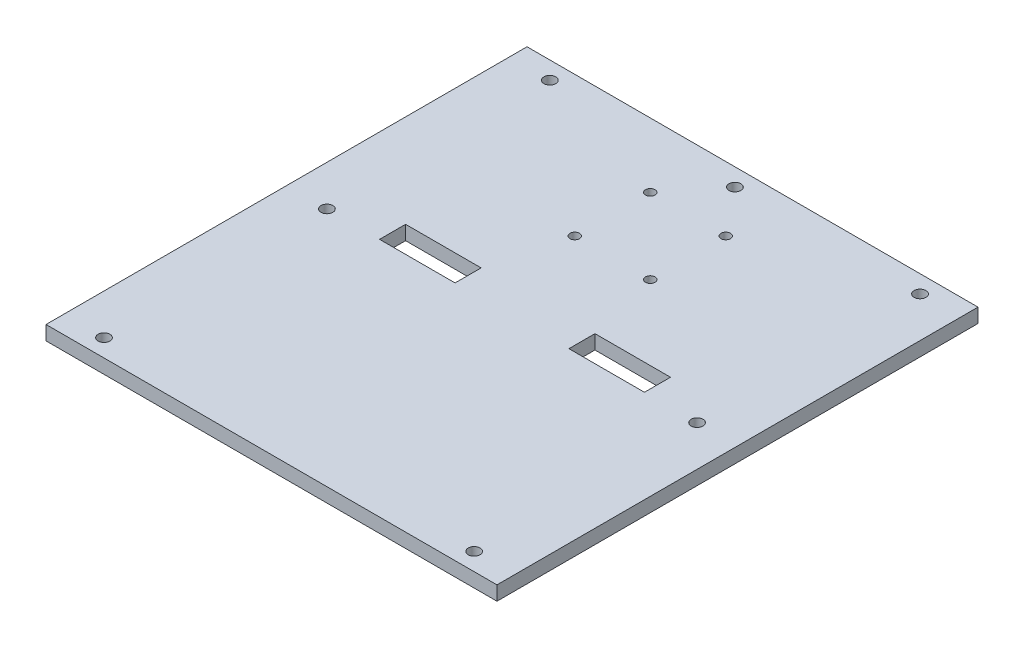
ISO-10303-21;
HEADER;
FILE_DESCRIPTION(('STEP AP214'),'2;1');
FILE_NAME('part.step','',(''),(''),'','','');
FILE_SCHEMA(('AUTOMOTIVE_DESIGN { 1 0 10303 214 1 1 1 1 }'));
ENDSEC;
DATA;
#1=APPLICATION_CONTEXT('core data for automotive mechanical design processes');
#2=APPLICATION_PROTOCOL_DEFINITION('international standard','automotive_design',2000,#1);
#3=PRODUCT_CONTEXT('',#1,'mechanical');
#4=PRODUCT('Part','Part','',(#3));
#5=PRODUCT_RELATED_PRODUCT_CATEGORY('part','',(#4));
#6=PRODUCT_DEFINITION_FORMATION('','',#4);
#7=PRODUCT_DEFINITION_CONTEXT('part definition',#1,'design');
#8=PRODUCT_DEFINITION('design','',#6,#7);
#9=PRODUCT_DEFINITION_SHAPE('','',#8);
#10=(LENGTH_UNIT() NAMED_UNIT(*) SI_UNIT(.MILLI.,.METRE.));
#11=(NAMED_UNIT(*) PLANE_ANGLE_UNIT() SI_UNIT($,.RADIAN.));
#12=(NAMED_UNIT(*) SI_UNIT($,.STERADIAN.) SOLID_ANGLE_UNIT());
#13=UNCERTAINTY_MEASURE_WITH_UNIT(LENGTH_MEASURE(1.E-05),#10,'distance_accuracy_value','');
#14=(GEOMETRIC_REPRESENTATION_CONTEXT(3) GLOBAL_UNCERTAINTY_ASSIGNED_CONTEXT((#13)) GLOBAL_UNIT_ASSIGNED_CONTEXT((#10,
#11,#12)) REPRESENTATION_CONTEXT('',''));
#15=CARTESIAN_POINT('',(0.,0.,0.));
#16=DIRECTION('',(0.,0.,1.));
#17=DIRECTION('',(1.,0.,0.));
#18=AXIS2_PLACEMENT_3D('',#15,#16,#17);
#19=CARTESIAN_POINT('',(0.,6.,0.));
#20=DIRECTION('',(0.,1.,0.));
#21=DIRECTION('',(0.,0.,1.));
#22=AXIS2_PLACEMENT_3D('',#19,#20,#21);
#23=PLANE('',#22);
#24=DIRECTION('',(-1.,0.,0.));
#25=VECTOR('',#24,1.);
#26=CARTESIAN_POINT('',(0.,6.,-11.));
#27=LINE('',#26,#25);
#28=CARTESIAN_POINT('',(55.95,6.,-11.));
#29=VERTEX_POINT('',#28);
#30=CARTESIAN_POINT('',(24.05,6.,-11.));
#31=VERTEX_POINT('',#30);
#32=EDGE_CURVE('E61',#29,#31,#27,.T.);
#33=ORIENTED_EDGE('',*,*,#32,.F.);
#34=DIRECTION('',(0.,0.,1.));
#35=VECTOR('',#34,1.);
#36=CARTESIAN_POINT('',(55.95,6.,0.));
#37=LINE('',#36,#35);
#38=CARTESIAN_POINT('',(55.95,6.,0.));
#39=VERTEX_POINT('',#38);
#40=EDGE_CURVE('E158',#29,#39,#37,.T.);
#41=ORIENTED_EDGE('',*,*,#40,.T.);
#42=DIRECTION('',(1.,0.,0.));
#43=VECTOR('',#42,1.);
#44=CARTESIAN_POINT('',(0.,6.,0.));
#45=LINE('',#44,#43);
#46=CARTESIAN_POINT('',(24.05,6.,0.));
#47=VERTEX_POINT('',#46);
#48=EDGE_CURVE('E142',#47,#39,#45,.T.);
#49=ORIENTED_EDGE('',*,*,#48,.F.);
#50=DIRECTION('',(0.,0.,1.));
#51=VECTOR('',#50,1.);
#52=CARTESIAN_POINT('',(24.05,6.,0.));
#53=LINE('',#52,#51);
#54=EDGE_CURVE('E152',#31,#47,#53,.T.);
#55=ORIENTED_EDGE('',*,*,#54,.F.);
#56=EDGE_LOOP('',(#33,#41,#49,#55));
#57=FACE_BOUND('',#56,.T.);
#58=CARTESIAN_POINT('',(-15.95,6.,-74.35));
#59=DIRECTION('',(0.,1.,0.));
#60=DIRECTION('',(0.,0.,1.));
#61=AXIS2_PLACEMENT_3D('',#58,#59,#60);
#62=CIRCLE('',#61,2.);
#63=CARTESIAN_POINT('',(-15.95,6.,-72.35));
#64=VERTEX_POINT('',#63);
#65=EDGE_CURVE('E168',#64,#64,#62,.T.);
#66=ORIENTED_EDGE('',*,*,#65,.F.);
#67=EDGE_LOOP('',(#66));
#68=FACE_BOUND('',#67,.T.);
#69=CARTESIAN_POINT('',(15.95,6.,-74.35));
#70=DIRECTION('',(0.,1.,0.));
#71=DIRECTION('',(0.,0.,1.));
#72=AXIS2_PLACEMENT_3D('',#69,#70,#71);
#73=CIRCLE('',#72,2.);
#74=CARTESIAN_POINT('',(15.95,6.,-72.35));
#75=VERTEX_POINT('',#74);
#76=EDGE_CURVE('E171',#75,#75,#73,.T.);
#77=ORIENTED_EDGE('',*,*,#76,.F.);
#78=EDGE_LOOP('',(#77));
#79=FACE_BOUND('',#78,.T.);
#80=CARTESIAN_POINT('',(15.95,6.,-42.45));
#81=DIRECTION('',(0.,1.,0.));
#82=DIRECTION('',(0.,0.,1.));
#83=AXIS2_PLACEMENT_3D('',#80,#81,#82);
#84=CIRCLE('',#83,2.);
#85=CARTESIAN_POINT('',(15.95,6.,-40.45));
#86=VERTEX_POINT('',#85);
#87=EDGE_CURVE('E193',#86,#86,#84,.T.);
#88=ORIENTED_EDGE('',*,*,#87,.F.);
#89=EDGE_LOOP('',(#88));
#90=FACE_BOUND('',#89,.T.);
#91=CARTESIAN_POINT('',(-15.95,6.,-42.45));
#92=DIRECTION('',(0.,1.,0.));
#93=DIRECTION('',(0.,0.,1.));
#94=AXIS2_PLACEMENT_3D('',#91,#92,#93);
#95=CIRCLE('',#94,2.);
#96=CARTESIAN_POINT('',(-15.95,6.,-40.45));
#97=VERTEX_POINT('',#96);
#98=EDGE_CURVE('E181',#97,#97,#95,.T.);
#99=ORIENTED_EDGE('',*,*,#98,.F.);
#100=EDGE_LOOP('',(#99));
#101=FACE_BOUND('',#100,.T.);
#102=CARTESIAN_POINT('',(78.1870361579999,6.,94.1650737980001));
#103=DIRECTION('',(0.,1.,0.));
#104=DIRECTION('',(0.,0.,1.));
#105=AXIS2_PLACEMENT_3D('',#102,#103,#104);
#106=CIRCLE('',#105,2.5);
#107=CARTESIAN_POINT('',(78.1870361579999,6.,96.6650737980001));
#108=VERTEX_POINT('',#107);
#109=EDGE_CURVE('E229',#108,#108,#106,.T.);
#110=ORIENTED_EDGE('',*,*,#109,.F.);
#111=EDGE_LOOP('',(#110));
#112=FACE_BOUND('',#111,.T.);
#113=CARTESIAN_POINT('',(78.187036158,6.,-94.165073798));
#114=DIRECTION('',(0.,-1.,0.));
#115=DIRECTION('',(0.,0.,-1.));
#116=AXIS2_PLACEMENT_3D('',#113,#114,#115);
#117=CIRCLE('',#116,2.5);
#118=CARTESIAN_POINT('',(78.187036158,6.,-96.6650737980001));
#119=VERTEX_POINT('',#118);
#120=EDGE_CURVE('E205',#119,#119,#117,.T.);
#121=ORIENTED_EDGE('',*,*,#120,.T.);
#122=EDGE_LOOP('',(#121));
#123=FACE_BOUND('',#122,.T.);
#124=CARTESIAN_POINT('',(0.,6.,-94.165073798));
#125=DIRECTION('',(0.,1.,0.));
#126=DIRECTION('',(0.,0.,1.));
#127=AXIS2_PLACEMENT_3D('',#124,#125,#126);
#128=CIRCLE('',#127,2.5);
#129=CARTESIAN_POINT('',(0.,6.,-91.665073798));
#130=VERTEX_POINT('',#129);
#131=EDGE_CURVE('E198',#130,#130,#128,.T.);
#132=ORIENTED_EDGE('',*,*,#131,.F.);
#133=EDGE_LOOP('',(#132));
#134=FACE_BOUND('',#133,.T.);
#135=CARTESIAN_POINT('',(-78.187036158,6.,-94.165073798));
#136=DIRECTION('',(0.,1.,0.));
#137=DIRECTION('',(0.,0.,1.));
#138=AXIS2_PLACEMENT_3D('',#135,#136,#137);
#139=CIRCLE('',#138,2.5);
#140=CARTESIAN_POINT('',(-78.187036158,6.,-91.665073798));
#141=VERTEX_POINT('',#140);
#142=EDGE_CURVE('E201',#141,#141,#139,.T.);
#143=ORIENTED_EDGE('',*,*,#142,.F.);
#144=EDGE_LOOP('',(#143));
#145=FACE_BOUND('',#144,.T.);
#146=DIRECTION('',(0.,0.,-1.));
#147=VECTOR('',#146,1.);
#148=CARTESIAN_POINT('',(95.25,6.,-101.6));
#149=LINE('',#148,#147);
#150=CARTESIAN_POINT('',(95.25,6.,101.6));
#151=VERTEX_POINT('',#150);
#152=CARTESIAN_POINT('',(95.25,6.,-101.6));
#153=VERTEX_POINT('',#152);
#154=EDGE_CURVE('E242',#151,#153,#149,.T.);
#155=ORIENTED_EDGE('',*,*,#154,.T.);
#156=DIRECTION('',(-1.,0.,0.));
#157=VECTOR('',#156,1.);
#158=CARTESIAN_POINT('',(-95.25,6.,-101.6));
#159=LINE('',#158,#157);
#160=CARTESIAN_POINT('',(-95.25,6.,-101.6));
#161=VERTEX_POINT('',#160);
#162=EDGE_CURVE('E245',#153,#161,#159,.T.);
#163=ORIENTED_EDGE('',*,*,#162,.T.);
#164=DIRECTION('',(0.,0.,1.));
#165=VECTOR('',#164,1.);
#166=CARTESIAN_POINT('',(-95.25,6.,-101.6));
#167=LINE('',#166,#165);
#168=CARTESIAN_POINT('',(-95.25,6.,101.6));
#169=VERTEX_POINT('',#168);
#170=EDGE_CURVE('E248',#161,#169,#167,.T.);
#171=ORIENTED_EDGE('',*,*,#170,.T.);
#172=DIRECTION('',(1.,0.,0.));
#173=VECTOR('',#172,1.);
#174=CARTESIAN_POINT('',(-95.25,6.,101.6));
#175=LINE('',#174,#173);
#176=EDGE_CURVE('E250',#169,#151,#175,.T.);
#177=ORIENTED_EDGE('',*,*,#176,.T.);
#178=EDGE_LOOP('',(#155,#163,#171,#177));
#179=FACE_BOUND('',#178,.T.);
#180=CARTESIAN_POINT('',(-78.187036158,6.,0.));
#181=DIRECTION('',(0.,1.,0.));
#182=DIRECTION('',(0.,0.,1.));
#183=AXIS2_PLACEMENT_3D('',#180,#181,#182);
#184=CIRCLE('',#183,2.50000000000001);
#185=CARTESIAN_POINT('',(-78.187036158,6.,2.5));
#186=VERTEX_POINT('',#185);
#187=EDGE_CURVE('E211',#186,#186,#184,.T.);
#188=ORIENTED_EDGE('',*,*,#187,.F.);
#189=EDGE_LOOP('',(#188));
#190=FACE_BOUND('',#189,.T.);
#191=CARTESIAN_POINT('',(78.1870361579999,6.,0.));
#192=DIRECTION('',(0.,1.,0.));
#193=DIRECTION('',(0.,0.,1.));
#194=AXIS2_PLACEMENT_3D('',#191,#192,#193);
#195=CIRCLE('',#194,2.50000000000001);
#196=CARTESIAN_POINT('',(78.1870361579999,6.,2.5));
#197=VERTEX_POINT('',#196);
#198=EDGE_CURVE('E217',#197,#197,#195,.T.);
#199=ORIENTED_EDGE('',*,*,#198,.F.);
#200=EDGE_LOOP('',(#199));
#201=FACE_BOUND('',#200,.T.);
#202=CARTESIAN_POINT('',(-78.1870361580001,6.,94.165073798));
#203=DIRECTION('',(0.,-1.,0.));
#204=DIRECTION('',(0.,0.,-1.));
#205=AXIS2_PLACEMENT_3D('',#202,#203,#204);
#206=CIRCLE('',#205,2.5);
#207=CARTESIAN_POINT('',(-78.1870361580001,6.,91.665073798));
#208=VERTEX_POINT('',#207);
#209=EDGE_CURVE('E223',#208,#208,#206,.T.);
#210=ORIENTED_EDGE('',*,*,#209,.T.);
#211=EDGE_LOOP('',(#210));
#212=FACE_BOUND('',#211,.T.);
#213=DIRECTION('',(0.,0.,1.));
#214=VECTOR('',#213,1.);
#215=CARTESIAN_POINT('',(-55.95,6.,0.));
#216=LINE('',#215,#214);
#217=CARTESIAN_POINT('',(-55.95,6.,-11.));
#218=VERTEX_POINT('',#217);
#219=CARTESIAN_POINT('',(-55.95,6.,0.));
#220=VERTEX_POINT('',#219);
#221=EDGE_CURVE('E187',#218,#220,#216,.T.);
#222=ORIENTED_EDGE('',*,*,#221,.F.);
#223=DIRECTION('',(1.,0.,0.));
#224=VECTOR('',#223,1.);
#225=CARTESIAN_POINT('',(0.,6.,-11.));
#226=LINE('',#225,#224);
#227=CARTESIAN_POINT('',(-24.05,6.,-11.));
#228=VERTEX_POINT('',#227);
#229=EDGE_CURVE('E69',#218,#228,#226,.T.);
#230=ORIENTED_EDGE('',*,*,#229,.T.);
#231=DIRECTION('',(0.,0.,1.));
#232=VECTOR('',#231,1.);
#233=CARTESIAN_POINT('',(-24.05,6.,0.));
#234=LINE('',#233,#232);
#235=CARTESIAN_POINT('',(-24.05,6.,0.));
#236=VERTEX_POINT('',#235);
#237=EDGE_CURVE('E174',#228,#236,#234,.T.);
#238=ORIENTED_EDGE('',*,*,#237,.T.);
#239=DIRECTION('',(1.,0.,0.));
#240=VECTOR('',#239,1.);
#241=CARTESIAN_POINT('',(0.,6.,0.));
#242=LINE('',#241,#240);
#243=EDGE_CURVE('E184',#220,#236,#242,.T.);
#244=ORIENTED_EDGE('',*,*,#243,.F.);
#245=EDGE_LOOP('',(#222,#230,#238,#244));
#246=FACE_BOUND('',#245,.T.);
#247=ADVANCED_FACE('F46',(#57,#68,#79,#90,#101,#112,#123,#134,#145,#179,#190,#201,#212,#246),
#23,.T.);
#248=CARTESIAN_POINT('',(0.,0.,0.));
#249=DIRECTION('',(0.,1.,0.));
#250=DIRECTION('',(0.,0.,1.));
#251=AXIS2_PLACEMENT_3D('',#248,#249,#250);
#252=PLANE('',#251);
#253=DIRECTION('',(0.,0.,1.));
#254=VECTOR('',#253,1.);
#255=CARTESIAN_POINT('',(55.95,0.,0.));
#256=LINE('',#255,#254);
#257=CARTESIAN_POINT('',(55.95,0.,-11.));
#258=VERTEX_POINT('',#257);
#259=CARTESIAN_POINT('',(55.95,0.,0.));
#260=VERTEX_POINT('',#259);
#261=EDGE_CURVE('E54',#258,#260,#256,.T.);
#262=ORIENTED_EDGE('',*,*,#261,.F.);
#263=DIRECTION('',(-1.,0.,0.));
#264=VECTOR('',#263,1.);
#265=CARTESIAN_POINT('',(0.,0.,-11.));
#266=LINE('',#265,#264);
#267=CARTESIAN_POINT('',(24.05,0.,-11.));
#268=VERTEX_POINT('',#267);
#269=EDGE_CURVE('E12',#258,#268,#266,.T.);
#270=ORIENTED_EDGE('',*,*,#269,.T.);
#271=DIRECTION('',(0.,0.,1.));
#272=VECTOR('',#271,1.);
#273=CARTESIAN_POINT('',(24.05,0.,0.));
#274=LINE('',#273,#272);
#275=CARTESIAN_POINT('',(24.05,0.,0.));
#276=VERTEX_POINT('',#275);
#277=EDGE_CURVE('E281',#268,#276,#274,.T.);
#278=ORIENTED_EDGE('',*,*,#277,.T.);
#279=DIRECTION('',(1.,0.,0.));
#280=VECTOR('',#279,1.);
#281=CARTESIAN_POINT('',(0.,0.,0.));
#282=LINE('',#281,#280);
#283=EDGE_CURVE('E145',#276,#260,#282,.T.);
#284=ORIENTED_EDGE('',*,*,#283,.T.);
#285=EDGE_LOOP('',(#262,#270,#278,#284));
#286=FACE_BOUND('',#285,.T.);
#287=CARTESIAN_POINT('',(-15.95,0.,-74.35));
#288=DIRECTION('',(0.,1.,0.));
#289=DIRECTION('',(0.,0.,1.));
#290=AXIS2_PLACEMENT_3D('',#287,#288,#289);
#291=CIRCLE('',#290,2.);
#292=CARTESIAN_POINT('',(-15.95,0.,-72.35));
#293=VERTEX_POINT('',#292);
#294=EDGE_CURVE('E235',#293,#293,#291,.T.);
#295=ORIENTED_EDGE('',*,*,#294,.T.);
#296=EDGE_LOOP('',(#295));
#297=FACE_BOUND('',#296,.T.);
#298=CARTESIAN_POINT('',(15.95,0.,-74.35));
#299=DIRECTION('',(0.,1.,0.));
#300=DIRECTION('',(0.,0.,1.));
#301=AXIS2_PLACEMENT_3D('',#298,#299,#300);
#302=CIRCLE('',#301,2.);
#303=CARTESIAN_POINT('',(15.95,0.,-72.35));
#304=VERTEX_POINT('',#303);
#305=EDGE_CURVE('E287',#304,#304,#302,.T.);
#306=ORIENTED_EDGE('',*,*,#305,.T.);
#307=EDGE_LOOP('',(#306));
#308=FACE_BOUND('',#307,.T.);
#309=CARTESIAN_POINT('',(15.95,0.,-42.45));
#310=DIRECTION('',(0.,1.,0.));
#311=DIRECTION('',(0.,0.,1.));
#312=AXIS2_PLACEMENT_3D('',#309,#310,#311);
#313=CIRCLE('',#312,2.);
#314=CARTESIAN_POINT('',(15.95,0.,-40.45));
#315=VERTEX_POINT('',#314);
#316=EDGE_CURVE('E284',#315,#315,#313,.T.);
#317=ORIENTED_EDGE('',*,*,#316,.T.);
#318=EDGE_LOOP('',(#317));
#319=FACE_BOUND('',#318,.T.);
#320=CARTESIAN_POINT('',(-15.95,0.,-42.45));
#321=DIRECTION('',(0.,1.,0.));
#322=DIRECTION('',(0.,0.,1.));
#323=AXIS2_PLACEMENT_3D('',#320,#321,#322);
#324=CIRCLE('',#323,2.);
#325=CARTESIAN_POINT('',(-15.95,0.,-40.45));
#326=VERTEX_POINT('',#325);
#327=EDGE_CURVE('E165',#326,#326,#324,.T.);
#328=ORIENTED_EDGE('',*,*,#327,.T.);
#329=EDGE_LOOP('',(#328));
#330=FACE_BOUND('',#329,.T.);
#331=CARTESIAN_POINT('',(-78.1870361580001,0.,94.165073798));
#332=DIRECTION('',(0.,-1.,0.));
#333=DIRECTION('',(0.,0.,-1.));
#334=AXIS2_PLACEMENT_3D('',#331,#332,#333);
#335=CIRCLE('',#334,2.5);
#336=CARTESIAN_POINT('',(-78.1870361580001,0.,91.665073798));
#337=VERTEX_POINT('',#336);
#338=EDGE_CURVE('E226',#337,#337,#335,.T.);
#339=ORIENTED_EDGE('',*,*,#338,.F.);
#340=EDGE_LOOP('',(#339));
#341=FACE_BOUND('',#340,.T.);
#342=CARTESIAN_POINT('',(78.187036158,0.,-94.165073798));
#343=DIRECTION('',(0.,-1.,0.));
#344=DIRECTION('',(0.,0.,-1.));
#345=AXIS2_PLACEMENT_3D('',#342,#343,#344);
#346=CIRCLE('',#345,2.5);
#347=CARTESIAN_POINT('',(78.187036158,0.,-96.6650737980001));
#348=VERTEX_POINT('',#347);
#349=EDGE_CURVE('E208',#348,#348,#346,.T.);
#350=ORIENTED_EDGE('',*,*,#349,.F.);
#351=EDGE_LOOP('',(#350));
#352=FACE_BOUND('',#351,.T.);
#353=DIRECTION('',(0.,0.,-1.));
#354=VECTOR('',#353,1.);
#355=CARTESIAN_POINT('',(95.25,0.,-101.6));
#356=LINE('',#355,#354);
#357=CARTESIAN_POINT('',(95.25,0.,101.6));
#358=VERTEX_POINT('',#357);
#359=CARTESIAN_POINT('',(95.25,0.,-101.6));
#360=VERTEX_POINT('',#359);
#361=EDGE_CURVE('E239',#358,#360,#356,.T.);
#362=ORIENTED_EDGE('',*,*,#361,.F.);
#363=DIRECTION('',(1.,0.,0.));
#364=VECTOR('',#363,1.);
#365=CARTESIAN_POINT('',(-95.25,0.,101.6));
#366=LINE('',#365,#364);
#367=CARTESIAN_POINT('',(-95.25,0.,101.6));
#368=VERTEX_POINT('',#367);
#369=EDGE_CURVE('E246',#368,#358,#366,.T.);
#370=ORIENTED_EDGE('',*,*,#369,.F.);
#371=DIRECTION('',(0.,0.,1.));
#372=VECTOR('',#371,1.);
#373=CARTESIAN_POINT('',(-95.25,0.,-101.6));
#374=LINE('',#373,#372);
#375=CARTESIAN_POINT('',(-95.25,0.,-101.6));
#376=VERTEX_POINT('',#375);
#377=EDGE_CURVE('E257',#376,#368,#374,.T.);
#378=ORIENTED_EDGE('',*,*,#377,.F.);
#379=DIRECTION('',(-1.,0.,0.));
#380=VECTOR('',#379,1.);
#381=CARTESIAN_POINT('',(-95.25,0.,-101.6));
#382=LINE('',#381,#380);
#383=EDGE_CURVE('E255',#360,#376,#382,.T.);
#384=ORIENTED_EDGE('',*,*,#383,.F.);
#385=EDGE_LOOP('',(#362,#370,#378,#384));
#386=FACE_BOUND('',#385,.T.);
#387=CARTESIAN_POINT('',(-78.187036158,0.,-94.165073798));
#388=DIRECTION('',(0.,1.,0.));
#389=DIRECTION('',(0.,0.,1.));
#390=AXIS2_PLACEMENT_3D('',#387,#388,#389);
#391=CIRCLE('',#390,2.5);
#392=CARTESIAN_POINT('',(-78.187036158,0.,-91.665073798));
#393=VERTEX_POINT('',#392);
#394=EDGE_CURVE('E236',#393,#393,#391,.T.);
#395=ORIENTED_EDGE('',*,*,#394,.T.);
#396=EDGE_LOOP('',(#395));
#397=FACE_BOUND('',#396,.T.);
#398=CARTESIAN_POINT('',(0.,0.,-94.165073798));
#399=DIRECTION('',(0.,1.,0.));
#400=DIRECTION('',(0.,0.,1.));
#401=AXIS2_PLACEMENT_3D('',#398,#399,#400);
#402=CIRCLE('',#401,2.5);
#403=CARTESIAN_POINT('',(0.,0.,-91.665073798));
#404=VERTEX_POINT('',#403);
#405=EDGE_CURVE('E202',#404,#404,#402,.T.);
#406=ORIENTED_EDGE('',*,*,#405,.T.);
#407=EDGE_LOOP('',(#406));
#408=FACE_BOUND('',#407,.T.);
#409=CARTESIAN_POINT('',(-78.187036158,0.,0.));
#410=DIRECTION('',(0.,1.,0.));
#411=DIRECTION('',(0.,0.,1.));
#412=AXIS2_PLACEMENT_3D('',#409,#410,#411);
#413=CIRCLE('',#412,2.50000000000001);
#414=CARTESIAN_POINT('',(-78.187036158,0.,2.5));
#415=VERTEX_POINT('',#414);
#416=EDGE_CURVE('E214',#415,#415,#413,.T.);
#417=ORIENTED_EDGE('',*,*,#416,.T.);
#418=EDGE_LOOP('',(#417));
#419=FACE_BOUND('',#418,.T.);
#420=CARTESIAN_POINT('',(78.1870361579999,0.,0.));
#421=DIRECTION('',(0.,1.,0.));
#422=DIRECTION('',(0.,0.,1.));
#423=AXIS2_PLACEMENT_3D('',#420,#421,#422);
#424=CIRCLE('',#423,2.50000000000001);
#425=CARTESIAN_POINT('',(78.1870361579999,0.,2.5));
#426=VERTEX_POINT('',#425);
#427=EDGE_CURVE('E220',#426,#426,#424,.T.);
#428=ORIENTED_EDGE('',*,*,#427,.T.);
#429=EDGE_LOOP('',(#428));
#430=FACE_BOUND('',#429,.T.);
#431=CARTESIAN_POINT('',(78.1870361579999,0.,94.1650737980001));
#432=DIRECTION('',(0.,1.,0.));
#433=DIRECTION('',(0.,0.,1.));
#434=AXIS2_PLACEMENT_3D('',#431,#432,#433);
#435=CIRCLE('',#434,2.5);
#436=CARTESIAN_POINT('',(78.1870361579999,0.,96.6650737980001));
#437=VERTEX_POINT('',#436);
#438=EDGE_CURVE('E232',#437,#437,#435,.T.);
#439=ORIENTED_EDGE('',*,*,#438,.T.);
#440=EDGE_LOOP('',(#439));
#441=FACE_BOUND('',#440,.T.);
#442=DIRECTION('',(1.,0.,0.));
#443=VECTOR('',#442,1.);
#444=CARTESIAN_POINT('',(0.,0.,-11.));
#445=LINE('',#444,#443);
#446=CARTESIAN_POINT('',(-55.95,0.,-11.));
#447=VERTEX_POINT('',#446);
#448=CARTESIAN_POINT('',(-24.05,0.,-11.));
#449=VERTEX_POINT('',#448);
#450=EDGE_CURVE('E279',#447,#449,#445,.T.);
#451=ORIENTED_EDGE('',*,*,#450,.F.);
#452=DIRECTION('',(0.,0.,1.));
#453=VECTOR('',#452,1.);
#454=CARTESIAN_POINT('',(-55.95,0.,0.));
#455=LINE('',#454,#453);
#456=CARTESIAN_POINT('',(-55.95,0.,0.));
#457=VERTEX_POINT('',#456);
#458=EDGE_CURVE('E271',#447,#457,#455,.T.);
#459=ORIENTED_EDGE('',*,*,#458,.T.);
#460=DIRECTION('',(1.,0.,0.));
#461=VECTOR('',#460,1.);
#462=CARTESIAN_POINT('',(0.,0.,0.));
#463=LINE('',#462,#461);
#464=CARTESIAN_POINT('',(-24.05,0.,0.));
#465=VERTEX_POINT('',#464);
#466=EDGE_CURVE('E274',#457,#465,#463,.T.);
#467=ORIENTED_EDGE('',*,*,#466,.T.);
#468=DIRECTION('',(0.,0.,1.));
#469=VECTOR('',#468,1.);
#470=CARTESIAN_POINT('',(-24.05,0.,0.));
#471=LINE('',#470,#469);
#472=EDGE_CURVE('E277',#449,#465,#471,.T.);
#473=ORIENTED_EDGE('',*,*,#472,.F.);
#474=EDGE_LOOP('',(#451,#459,#467,#473));
#475=FACE_BOUND('',#474,.T.);
#476=ADVANCED_FACE('F298',(#286,#297,#308,#319,#330,#341,#352,#386,#397,#408,#419,#430,#441,
#475),#252,.F.);
#477=CARTESIAN_POINT('',(95.25,6.,-101.6));
#478=DIRECTION('',(-1.,0.,0.));
#479=DIRECTION('',(0.,0.,1.));
#480=AXIS2_PLACEMENT_3D('',#477,#478,#479);
#481=PLANE('',#480);
#482=ORIENTED_EDGE('',*,*,#361,.T.);
#483=DIRECTION('',(0.,-1.,0.));
#484=VECTOR('',#483,1.);
#485=CARTESIAN_POINT('',(95.25,6.,-101.6));
#486=LINE('',#485,#484);
#487=EDGE_CURVE('E268',#153,#360,#486,.T.);
#488=ORIENTED_EDGE('',*,*,#487,.F.);
#489=ORIENTED_EDGE('',*,*,#154,.F.);
#490=DIRECTION('',(0.,-1.,0.));
#491=VECTOR('',#490,1.);
#492=CARTESIAN_POINT('',(95.25,6.,101.6));
#493=LINE('',#492,#491);
#494=EDGE_CURVE('E252',#151,#358,#493,.T.);
#495=ORIENTED_EDGE('',*,*,#494,.T.);
#496=EDGE_LOOP('',(#482,#488,#489,#495));
#497=FACE_BOUND('',#496,.T.);
#498=ADVANCED_FACE('F48',(#497),#481,.F.);
#499=CARTESIAN_POINT('',(-95.25,6.,-101.6));
#500=DIRECTION('',(0.,0.,1.));
#501=DIRECTION('',(1.,0.,0.));
#502=AXIS2_PLACEMENT_3D('',#499,#500,#501);
#503=PLANE('',#502);
#504=ORIENTED_EDGE('',*,*,#383,.T.);
#505=DIRECTION('',(0.,-1.,0.));
#506=VECTOR('',#505,1.);
#507=CARTESIAN_POINT('',(-95.25,6.,-101.6));
#508=LINE('',#507,#506);
#509=EDGE_CURVE('E265',#161,#376,#508,.T.);
#510=ORIENTED_EDGE('',*,*,#509,.F.);
#511=ORIENTED_EDGE('',*,*,#162,.F.);
#512=ORIENTED_EDGE('',*,*,#487,.T.);
#513=EDGE_LOOP('',(#504,#510,#511,#512));
#514=FACE_BOUND('',#513,.T.);
#515=ADVANCED_FACE('F330',(#514),#503,.F.);
#516=CARTESIAN_POINT('',(-95.25,6.,-101.6));
#517=DIRECTION('',(1.,0.,0.));
#518=DIRECTION('',(0.,0.,-1.));
#519=AXIS2_PLACEMENT_3D('',#516,#517,#518);
#520=PLANE('',#519);
#521=ORIENTED_EDGE('',*,*,#377,.T.);
#522=DIRECTION('',(0.,-1.,0.));
#523=VECTOR('',#522,1.);
#524=CARTESIAN_POINT('',(-95.25,6.,101.6));
#525=LINE('',#524,#523);
#526=EDGE_CURVE('E262',#169,#368,#525,.T.);
#527=ORIENTED_EDGE('',*,*,#526,.F.);
#528=ORIENTED_EDGE('',*,*,#170,.F.);
#529=ORIENTED_EDGE('',*,*,#509,.T.);
#530=EDGE_LOOP('',(#521,#527,#528,#529));
#531=FACE_BOUND('',#530,.T.);
#532=ADVANCED_FACE('F327',(#531),#520,.F.);
#533=CARTESIAN_POINT('',(-95.25,6.,101.6));
#534=DIRECTION('',(0.,0.,-1.));
#535=DIRECTION('',(-1.,0.,0.));
#536=AXIS2_PLACEMENT_3D('',#533,#534,#535);
#537=PLANE('',#536);
#538=ORIENTED_EDGE('',*,*,#369,.T.);
#539=ORIENTED_EDGE('',*,*,#494,.F.);
#540=ORIENTED_EDGE('',*,*,#176,.F.);
#541=ORIENTED_EDGE('',*,*,#526,.T.);
#542=EDGE_LOOP('',(#538,#539,#540,#541));
#543=FACE_BOUND('',#542,.T.);
#544=ADVANCED_FACE('F324',(#543),#537,.F.);
#545=CARTESIAN_POINT('',(-78.187036158,0.,-94.165073798));
#546=DIRECTION('',(0.,1.,0.));
#547=DIRECTION('',(0.,0.,1.));
#548=AXIS2_PLACEMENT_3D('',#545,#546,#547);
#549=CYLINDRICAL_SURFACE('',#548,2.5);
#550=ORIENTED_EDGE('',*,*,#394,.F.);
#551=EDGE_LOOP('',(#550));
#552=FACE_BOUND('',#551,.T.);
#553=ORIENTED_EDGE('',*,*,#142,.T.);
#554=EDGE_LOOP('',(#553));
#555=FACE_BOUND('',#554,.T.);
#556=ADVANCED_FACE('F321',(#552,#555),#549,.F.);
#557=CARTESIAN_POINT('',(0.,0.,-94.165073798));
#558=DIRECTION('',(0.,1.,0.));
#559=DIRECTION('',(0.,0.,1.));
#560=AXIS2_PLACEMENT_3D('',#557,#558,#559);
#561=CYLINDRICAL_SURFACE('',#560,2.5);
#562=ORIENTED_EDGE('',*,*,#405,.F.);
#563=EDGE_LOOP('',(#562));
#564=FACE_BOUND('',#563,.T.);
#565=ORIENTED_EDGE('',*,*,#131,.T.);
#566=EDGE_LOOP('',(#565));
#567=FACE_BOUND('',#566,.T.);
#568=ADVANCED_FACE('F395',(#564,#567),#561,.F.);
#569=CARTESIAN_POINT('',(78.187036158,0.,-94.165073798));
#570=DIRECTION('',(0.,1.,0.));
#571=DIRECTION('',(0.,0.,1.));
#572=AXIS2_PLACEMENT_3D('',#569,#570,#571);
#573=CYLINDRICAL_SURFACE('',#572,2.5);
#574=ORIENTED_EDGE('',*,*,#349,.T.);
#575=EDGE_LOOP('',(#574));
#576=FACE_BOUND('',#575,.T.);
#577=ORIENTED_EDGE('',*,*,#120,.F.);
#578=EDGE_LOOP('',(#577));
#579=FACE_BOUND('',#578,.T.);
#580=ADVANCED_FACE('F398',(#576,#579),#573,.F.);
#581=CARTESIAN_POINT('',(-78.187036158,0.,0.));
#582=DIRECTION('',(0.,1.,0.));
#583=DIRECTION('',(0.,0.,1.));
#584=AXIS2_PLACEMENT_3D('',#581,#582,#583);
#585=CYLINDRICAL_SURFACE('',#584,2.50000000000001);
#586=ORIENTED_EDGE('',*,*,#416,.F.);
#587=EDGE_LOOP('',(#586));
#588=FACE_BOUND('',#587,.T.);
#589=ORIENTED_EDGE('',*,*,#187,.T.);
#590=EDGE_LOOP('',(#589));
#591=FACE_BOUND('',#590,.T.);
#592=ADVANCED_FACE('F402',(#588,#591),#585,.F.);
#593=CARTESIAN_POINT('',(78.1870361579999,0.,0.));
#594=DIRECTION('',(0.,1.,0.));
#595=DIRECTION('',(0.,0.,1.));
#596=AXIS2_PLACEMENT_3D('',#593,#594,#595);
#597=CYLINDRICAL_SURFACE('',#596,2.50000000000001);
#598=ORIENTED_EDGE('',*,*,#427,.F.);
#599=EDGE_LOOP('',(#598));
#600=FACE_BOUND('',#599,.T.);
#601=ORIENTED_EDGE('',*,*,#198,.T.);
#602=EDGE_LOOP('',(#601));
#603=FACE_BOUND('',#602,.T.);
#604=ADVANCED_FACE('F406',(#600,#603),#597,.F.);
#605=CARTESIAN_POINT('',(-78.1870361580001,0.,94.165073798));
#606=DIRECTION('',(0.,1.,0.));
#607=DIRECTION('',(0.,0.,1.));
#608=AXIS2_PLACEMENT_3D('',#605,#606,#607);
#609=CYLINDRICAL_SURFACE('',#608,2.5);
#610=ORIENTED_EDGE('',*,*,#338,.T.);
#611=EDGE_LOOP('',(#610));
#612=FACE_BOUND('',#611,.T.);
#613=ORIENTED_EDGE('',*,*,#209,.F.);
#614=EDGE_LOOP('',(#613));
#615=FACE_BOUND('',#614,.T.);
#616=ADVANCED_FACE('F410',(#612,#615),#609,.F.);
#617=CARTESIAN_POINT('',(78.1870361579999,0.,94.1650737980001));
#618=DIRECTION('',(0.,1.,0.));
#619=DIRECTION('',(0.,0.,1.));
#620=AXIS2_PLACEMENT_3D('',#617,#618,#619);
#621=CYLINDRICAL_SURFACE('',#620,2.5);
#622=ORIENTED_EDGE('',*,*,#438,.F.);
#623=EDGE_LOOP('',(#622));
#624=FACE_BOUND('',#623,.T.);
#625=ORIENTED_EDGE('',*,*,#109,.T.);
#626=EDGE_LOOP('',(#625));
#627=FACE_BOUND('',#626,.T.);
#628=ADVANCED_FACE('F413',(#624,#627),#621,.F.);
#629=CARTESIAN_POINT('',(0.,-4.,-11.));
#630=DIRECTION('',(0.,0.,1.));
#631=DIRECTION('',(1.,0.,0.));
#632=AXIS2_PLACEMENT_3D('',#629,#630,#631);
#633=PLANE('',#632);
#634=ORIENTED_EDGE('',*,*,#450,.T.);
#635=DIRECTION('',(0.,1.,0.));
#636=VECTOR('',#635,1.);
#637=CARTESIAN_POINT('',(-24.05,-4.,-11.));
#638=LINE('',#637,#636);
#639=EDGE_CURVE('E179',#449,#228,#638,.T.);
#640=ORIENTED_EDGE('',*,*,#639,.T.);
#641=ORIENTED_EDGE('',*,*,#229,.F.);
#642=DIRECTION('',(0.,1.,0.));
#643=VECTOR('',#642,1.);
#644=CARTESIAN_POINT('',(-55.95,-4.,-11.));
#645=LINE('',#644,#643);
#646=EDGE_CURVE('E172',#447,#218,#645,.T.);
#647=ORIENTED_EDGE('',*,*,#646,.F.);
#648=EDGE_LOOP('',(#634,#640,#641,#647));
#649=FACE_BOUND('',#648,.T.);
#650=ADVANCED_FACE('F364',(#649),#633,.T.);
#651=CARTESIAN_POINT('',(-24.05,-4.,0.));
#652=DIRECTION('',(-1.,0.,0.));
#653=DIRECTION('',(0.,0.,1.));
#654=AXIS2_PLACEMENT_3D('',#651,#652,#653);
#655=PLANE('',#654);
#656=ORIENTED_EDGE('',*,*,#472,.T.);
#657=DIRECTION('',(0.,1.,0.));
#658=VECTOR('',#657,1.);
#659=CARTESIAN_POINT('',(-24.05,-4.,0.));
#660=LINE('',#659,#658);
#661=EDGE_CURVE('E177',#465,#236,#660,.T.);
#662=ORIENTED_EDGE('',*,*,#661,.T.);
#663=ORIENTED_EDGE('',*,*,#237,.F.);
#664=ORIENTED_EDGE('',*,*,#639,.F.);
#665=EDGE_LOOP('',(#656,#662,#663,#664));
#666=FACE_BOUND('',#665,.T.);
#667=ADVANCED_FACE('F370',(#666),#655,.T.);
#668=CARTESIAN_POINT('',(0.,-4.,0.));
#669=DIRECTION('',(0.,0.,1.));
#670=DIRECTION('',(1.,0.,0.));
#671=AXIS2_PLACEMENT_3D('',#668,#669,#670);
#672=PLANE('',#671);
#673=DIRECTION('',(0.,1.,0.));
#674=VECTOR('',#673,1.);
#675=CARTESIAN_POINT('',(-55.95,-4.,0.));
#676=LINE('',#675,#674);
#677=EDGE_CURVE('E175',#457,#220,#676,.T.);
#678=ORIENTED_EDGE('',*,*,#677,.T.);
#679=ORIENTED_EDGE('',*,*,#243,.T.);
#680=ORIENTED_EDGE('',*,*,#661,.F.);
#681=ORIENTED_EDGE('',*,*,#466,.F.);
#682=EDGE_LOOP('',(#678,#679,#680,#681));
#683=FACE_BOUND('',#682,.T.);
#684=ADVANCED_FACE('F373',(#683),#672,.F.);
#685=CARTESIAN_POINT('',(-55.95,-4.,0.));
#686=DIRECTION('',(-1.,0.,0.));
#687=DIRECTION('',(0.,0.,1.));
#688=AXIS2_PLACEMENT_3D('',#685,#686,#687);
#689=PLANE('',#688);
#690=ORIENTED_EDGE('',*,*,#646,.T.);
#691=ORIENTED_EDGE('',*,*,#221,.T.);
#692=ORIENTED_EDGE('',*,*,#677,.F.);
#693=ORIENTED_EDGE('',*,*,#458,.F.);
#694=EDGE_LOOP('',(#690,#691,#692,#693));
#695=FACE_BOUND('',#694,.T.);
#696=ADVANCED_FACE('F361',(#695),#689,.F.);
#697=CARTESIAN_POINT('',(-15.95,-4.,-42.45));
#698=DIRECTION('',(0.,1.,0.));
#699=DIRECTION('',(0.,0.,1.));
#700=AXIS2_PLACEMENT_3D('',#697,#698,#699);
#701=CYLINDRICAL_SURFACE('',#700,2.);
#702=ORIENTED_EDGE('',*,*,#98,.T.);
#703=EDGE_LOOP('',(#702));
#704=FACE_BOUND('',#703,.T.);
#705=ORIENTED_EDGE('',*,*,#327,.F.);
#706=EDGE_LOOP('',(#705));
#707=FACE_BOUND('',#706,.T.);
#708=ADVANCED_FACE('F380',(#704,#707),#701,.F.);
#709=CARTESIAN_POINT('',(15.95,-4.,-42.45));
#710=DIRECTION('',(0.,1.,0.));
#711=DIRECTION('',(0.,0.,1.));
#712=AXIS2_PLACEMENT_3D('',#709,#710,#711);
#713=CYLINDRICAL_SURFACE('',#712,2.);
#714=ORIENTED_EDGE('',*,*,#87,.T.);
#715=EDGE_LOOP('',(#714));
#716=FACE_BOUND('',#715,.T.);
#717=ORIENTED_EDGE('',*,*,#316,.F.);
#718=EDGE_LOOP('',(#717));
#719=FACE_BOUND('',#718,.T.);
#720=ADVANCED_FACE('F387',(#716,#719),#713,.F.);
#721=CARTESIAN_POINT('',(15.95,-4.,-74.35));
#722=DIRECTION('',(0.,1.,0.));
#723=DIRECTION('',(0.,0.,1.));
#724=AXIS2_PLACEMENT_3D('',#721,#722,#723);
#725=CYLINDRICAL_SURFACE('',#724,2.);
#726=ORIENTED_EDGE('',*,*,#76,.T.);
#727=EDGE_LOOP('',(#726));
#728=FACE_BOUND('',#727,.T.);
#729=ORIENTED_EDGE('',*,*,#305,.F.);
#730=EDGE_LOOP('',(#729));
#731=FACE_BOUND('',#730,.T.);
#732=ADVANCED_FACE('F309',(#728,#731),#725,.F.);
#733=CARTESIAN_POINT('',(-15.95,-4.,-74.35));
#734=DIRECTION('',(0.,1.,0.));
#735=DIRECTION('',(0.,0.,1.));
#736=AXIS2_PLACEMENT_3D('',#733,#734,#735);
#737=CYLINDRICAL_SURFACE('',#736,2.);
#738=ORIENTED_EDGE('',*,*,#65,.T.);
#739=EDGE_LOOP('',(#738));
#740=FACE_BOUND('',#739,.T.);
#741=ORIENTED_EDGE('',*,*,#294,.F.);
#742=EDGE_LOOP('',(#741));
#743=FACE_BOUND('',#742,.T.);
#744=ADVANCED_FACE('F302',(#740,#743),#737,.F.);
#745=CARTESIAN_POINT('',(0.,-4.,-11.));
#746=DIRECTION('',(0.,0.,-1.));
#747=DIRECTION('',(-1.,0.,0.));
#748=AXIS2_PLACEMENT_3D('',#745,#746,#747);
#749=PLANE('',#748);
#750=DIRECTION('',(0.,1.,0.));
#751=VECTOR('',#750,1.);
#752=CARTESIAN_POINT('',(55.95,-4.,-11.));
#753=LINE('',#752,#751);
#754=EDGE_CURVE('E163',#258,#29,#753,.T.);
#755=ORIENTED_EDGE('',*,*,#754,.T.);
#756=ORIENTED_EDGE('',*,*,#32,.T.);
#757=DIRECTION('',(0.,1.,0.));
#758=VECTOR('',#757,1.);
#759=CARTESIAN_POINT('',(24.05,-4.,-11.));
#760=LINE('',#759,#758);
#761=EDGE_CURVE('E149',#268,#31,#760,.T.);
#762=ORIENTED_EDGE('',*,*,#761,.F.);
#763=ORIENTED_EDGE('',*,*,#269,.F.);
#764=EDGE_LOOP('',(#755,#756,#762,#763));
#765=FACE_BOUND('',#764,.T.);
#766=ADVANCED_FACE('F300',(#765),#749,.F.);
#767=CARTESIAN_POINT('',(55.95,-4.,0.));
#768=DIRECTION('',(-1.,0.,0.));
#769=DIRECTION('',(0.,0.,1.));
#770=AXIS2_PLACEMENT_3D('',#767,#768,#769);
#771=PLANE('',#770);
#772=ORIENTED_EDGE('',*,*,#261,.T.);
#773=DIRECTION('',(0.,1.,0.));
#774=VECTOR('',#773,1.);
#775=CARTESIAN_POINT('',(55.95,-4.,0.));
#776=LINE('',#775,#774);
#777=EDGE_CURVE('E148',#260,#39,#776,.T.);
#778=ORIENTED_EDGE('',*,*,#777,.T.);
#779=ORIENTED_EDGE('',*,*,#40,.F.);
#780=ORIENTED_EDGE('',*,*,#754,.F.);
#781=EDGE_LOOP('',(#772,#778,#779,#780));
#782=FACE_BOUND('',#781,.T.);
#783=ADVANCED_FACE('F296',(#782),#771,.T.);
#784=CARTESIAN_POINT('',(0.,-4.,0.));
#785=DIRECTION('',(0.,0.,1.));
#786=DIRECTION('',(1.,0.,0.));
#787=AXIS2_PLACEMENT_3D('',#784,#785,#786);
#788=PLANE('',#787);
#789=DIRECTION('',(0.,1.,0.));
#790=VECTOR('',#789,1.);
#791=CARTESIAN_POINT('',(24.05,-4.,0.));
#792=LINE('',#791,#790);
#793=EDGE_CURVE('E137',#276,#47,#792,.T.);
#794=ORIENTED_EDGE('',*,*,#793,.T.);
#795=ORIENTED_EDGE('',*,*,#48,.T.);
#796=ORIENTED_EDGE('',*,*,#777,.F.);
#797=ORIENTED_EDGE('',*,*,#283,.F.);
#798=EDGE_LOOP('',(#794,#795,#796,#797));
#799=FACE_BOUND('',#798,.T.);
#800=ADVANCED_FACE('F139',(#799),#788,.F.);
#801=CARTESIAN_POINT('',(24.05,-4.,0.));
#802=DIRECTION('',(-1.,0.,0.));
#803=DIRECTION('',(0.,0.,1.));
#804=AXIS2_PLACEMENT_3D('',#801,#802,#803);
#805=PLANE('',#804);
#806=ORIENTED_EDGE('',*,*,#761,.T.);
#807=ORIENTED_EDGE('',*,*,#54,.T.);
#808=ORIENTED_EDGE('',*,*,#793,.F.);
#809=ORIENTED_EDGE('',*,*,#277,.F.);
#810=EDGE_LOOP('',(#806,#807,#808,#809));
#811=FACE_BOUND('',#810,.T.);
#812=ADVANCED_FACE('F153',(#811),#805,.F.);
#813=CLOSED_SHELL('',(#247,#476,#498,#515,#532,#544,#556,#568,#580,#592,#604,#616,#628,#650,
#667,#684,#696,#708,#720,#732,#744,#766,#783,#800,#812));
#814=MANIFOLD_SOLID_BREP('B2',#813);
#815=ADVANCED_BREP_SHAPE_REPRESENTATION('',(#18,#814),#14);
#816=SHAPE_DEFINITION_REPRESENTATION(#9,#815);
ENDSEC;
END-ISO-10303-21;
